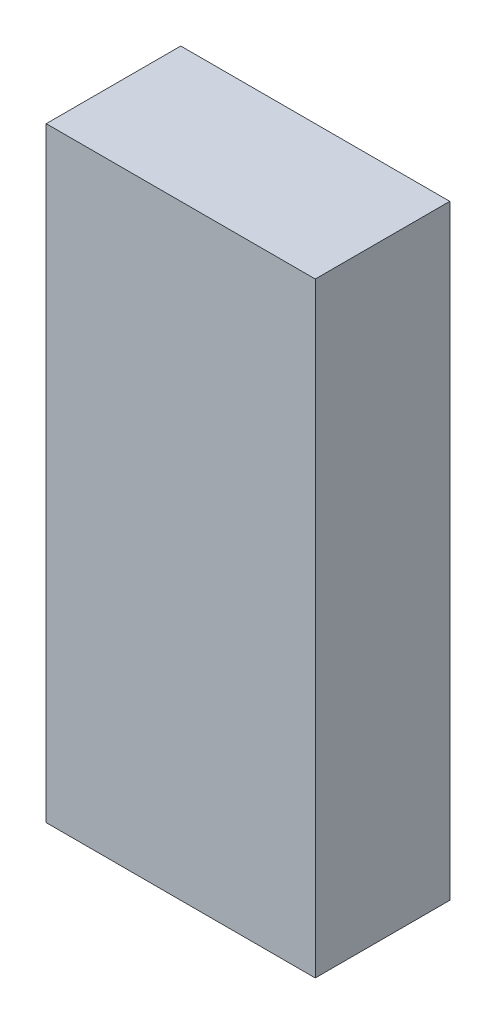
ISO-10303-21;
HEADER;
FILE_DESCRIPTION(('STEP AP214'),'2;1');
FILE_NAME('part.step','',(''),(''),'','','');
FILE_SCHEMA(('AUTOMOTIVE_DESIGN { 1 0 10303 214 1 1 1 1 }'));
ENDSEC;
DATA;
#1=APPLICATION_CONTEXT('core data for automotive mechanical design processes');
#2=APPLICATION_PROTOCOL_DEFINITION('international standard','automotive_design',2000,#1);
#3=PRODUCT_CONTEXT('',#1,'mechanical');
#4=PRODUCT('Part','Part','',(#3));
#5=PRODUCT_RELATED_PRODUCT_CATEGORY('part','',(#4));
#6=PRODUCT_DEFINITION_FORMATION('','',#4);
#7=PRODUCT_DEFINITION_CONTEXT('part definition',#1,'design');
#8=PRODUCT_DEFINITION('design','',#6,#7);
#9=PRODUCT_DEFINITION_SHAPE('','',#8);
#10=(LENGTH_UNIT() NAMED_UNIT(*) SI_UNIT(.MILLI.,.METRE.));
#11=(NAMED_UNIT(*) PLANE_ANGLE_UNIT() SI_UNIT($,.RADIAN.));
#12=(NAMED_UNIT(*) SI_UNIT($,.STERADIAN.) SOLID_ANGLE_UNIT());
#13=UNCERTAINTY_MEASURE_WITH_UNIT(LENGTH_MEASURE(1.E-05),#10,'distance_accuracy_value','');
#14=(GEOMETRIC_REPRESENTATION_CONTEXT(3) GLOBAL_UNCERTAINTY_ASSIGNED_CONTEXT((#13)) GLOBAL_UNIT_ASSIGNED_CONTEXT((#10,
#11,#12)) REPRESENTATION_CONTEXT('',''));
#15=CARTESIAN_POINT('',(0.,0.,0.));
#16=DIRECTION('',(0.,0.,1.));
#17=DIRECTION('',(1.,0.,0.));
#18=AXIS2_PLACEMENT_3D('',#15,#16,#17);
#19=CARTESIAN_POINT('',(-1.1,2.525,0.));
#20=DIRECTION('',(1.,0.,0.));
#21=DIRECTION('',(0.,0.,1.));
#22=AXIS2_PLACEMENT_3D('',#19,#20,#21);
#23=PLANE('',#22);
#24=DIRECTION('',(0.,1.,0.));
#25=VECTOR('',#24,1.);
#26=CARTESIAN_POINT('',(-1.1,2.525,0.1));
#27=LINE('',#26,#25);
#28=CARTESIAN_POINT('',(-1.1,2.525,0.1));
#29=VERTEX_POINT('',#28);
#30=CARTESIAN_POINT('',(-1.1,2.975,0.1));
#31=VERTEX_POINT('',#30);
#32=EDGE_CURVE('E11',#29,#31,#27,.T.);
#33=ORIENTED_EDGE('',*,*,#32,.T.);
#34=DIRECTION('',(0.,0.,1.));
#35=VECTOR('',#34,1.);
#36=CARTESIAN_POINT('',(-1.1,2.975,0.));
#37=LINE('',#36,#35);
#38=CARTESIAN_POINT('',(-1.1,2.975,0.));
#39=VERTEX_POINT('',#38);
#40=EDGE_CURVE('E24',#39,#31,#37,.T.);
#41=ORIENTED_EDGE('',*,*,#40,.F.);
#42=DIRECTION('',(0.,1.,0.));
#43=VECTOR('',#42,1.);
#44=CARTESIAN_POINT('',(-1.1,2.525,0.));
#45=LINE('',#44,#43);
#46=CARTESIAN_POINT('',(-1.1,2.525,0.));
#47=VERTEX_POINT('',#46);
#48=EDGE_CURVE('E86',#47,#39,#45,.T.);
#49=ORIENTED_EDGE('',*,*,#48,.F.);
#50=DIRECTION('',(0.,0.,1.));
#51=VECTOR('',#50,1.);
#52=CARTESIAN_POINT('',(-1.1,2.525,0.));
#53=LINE('',#52,#51);
#54=EDGE_CURVE('E36',#47,#29,#53,.T.);
#55=ORIENTED_EDGE('',*,*,#54,.T.);
#56=EDGE_LOOP('',(#33,#41,#49,#55));
#57=FACE_BOUND('',#56,.T.);
#58=ADVANCED_FACE('F17',(#57),#23,.F.);
#59=CARTESIAN_POINT('',(-0.9,2.525,0.));
#60=DIRECTION('',(1.,0.,0.));
#61=DIRECTION('',(0.,0.,1.));
#62=AXIS2_PLACEMENT_3D('',#59,#60,#61);
#63=PLANE('',#62);
#64=DIRECTION('',(0.,0.,1.));
#65=VECTOR('',#64,1.);
#66=CARTESIAN_POINT('',(-0.9,2.525,0.));
#67=LINE('',#66,#65);
#68=CARTESIAN_POINT('',(-0.9,2.525,0.));
#69=VERTEX_POINT('',#68);
#70=CARTESIAN_POINT('',(-0.9,2.525,0.1));
#71=VERTEX_POINT('',#70);
#72=EDGE_CURVE('E83',#69,#71,#67,.T.);
#73=ORIENTED_EDGE('',*,*,#72,.F.);
#74=DIRECTION('',(0.,1.,0.));
#75=VECTOR('',#74,1.);
#76=CARTESIAN_POINT('',(-0.9,2.525,0.));
#77=LINE('',#76,#75);
#78=CARTESIAN_POINT('',(-0.9,2.975,0.));
#79=VERTEX_POINT('',#78);
#80=EDGE_CURVE('E63',#69,#79,#77,.T.);
#81=ORIENTED_EDGE('',*,*,#80,.T.);
#82=DIRECTION('',(0.,0.,1.));
#83=VECTOR('',#82,1.);
#84=CARTESIAN_POINT('',(-0.9,2.975,0.));
#85=LINE('',#84,#83);
#86=CARTESIAN_POINT('',(-0.9,2.975,0.1));
#87=VERTEX_POINT('',#86);
#88=EDGE_CURVE('E57',#79,#87,#85,.T.);
#89=ORIENTED_EDGE('',*,*,#88,.T.);
#90=DIRECTION('',(0.,1.,0.));
#91=VECTOR('',#90,1.);
#92=CARTESIAN_POINT('',(-0.9,2.525,0.1));
#93=LINE('',#92,#91);
#94=EDGE_CURVE('E60',#71,#87,#93,.T.);
#95=ORIENTED_EDGE('',*,*,#94,.F.);
#96=EDGE_LOOP('',(#73,#81,#89,#95));
#97=FACE_BOUND('',#96,.T.);
#98=ADVANCED_FACE('F59',(#97),#63,.T.);
#99=CARTESIAN_POINT('',(-1.1,2.525,0.));
#100=DIRECTION('',(0.,1.,0.));
#101=DIRECTION('',(0.,0.,1.));
#102=AXIS2_PLACEMENT_3D('',#99,#100,#101);
#103=PLANE('',#102);
#104=ORIENTED_EDGE('',*,*,#72,.T.);
#105=DIRECTION('',(1.,0.,0.));
#106=VECTOR('',#105,1.);
#107=CARTESIAN_POINT('',(-1.1,2.525,0.1));
#108=LINE('',#107,#106);
#109=EDGE_CURVE('E71',#29,#71,#108,.T.);
#110=ORIENTED_EDGE('',*,*,#109,.F.);
#111=ORIENTED_EDGE('',*,*,#54,.F.);
#112=DIRECTION('',(1.,0.,0.));
#113=VECTOR('',#112,1.);
#114=CARTESIAN_POINT('',(-1.1,2.525,0.));
#115=LINE('',#114,#113);
#116=EDGE_CURVE('E76',#47,#69,#115,.T.);
#117=ORIENTED_EDGE('',*,*,#116,.T.);
#118=EDGE_LOOP('',(#104,#110,#111,#117));
#119=FACE_BOUND('',#118,.T.);
#120=ADVANCED_FACE('F91',(#119),#103,.F.);
#121=CARTESIAN_POINT('',(-1.1,2.975,0.));
#122=DIRECTION('',(0.,1.,0.));
#123=DIRECTION('',(0.,0.,1.));
#124=AXIS2_PLACEMENT_3D('',#121,#122,#123);
#125=PLANE('',#124);
#126=DIRECTION('',(1.,0.,0.));
#127=VECTOR('',#126,1.);
#128=CARTESIAN_POINT('',(-1.1,2.975,0.));
#129=LINE('',#128,#127);
#130=EDGE_CURVE('E74',#39,#79,#129,.T.);
#131=ORIENTED_EDGE('',*,*,#130,.F.);
#132=ORIENTED_EDGE('',*,*,#40,.T.);
#133=DIRECTION('',(1.,0.,0.));
#134=VECTOR('',#133,1.);
#135=CARTESIAN_POINT('',(-1.1,2.975,0.1));
#136=LINE('',#135,#134);
#137=EDGE_CURVE('E69',#31,#87,#136,.T.);
#138=ORIENTED_EDGE('',*,*,#137,.T.);
#139=ORIENTED_EDGE('',*,*,#88,.F.);
#140=EDGE_LOOP('',(#131,#132,#138,#139));
#141=FACE_BOUND('',#140,.T.);
#142=ADVANCED_FACE('F73',(#141),#125,.T.);
#143=CARTESIAN_POINT('',(-1.1,2.525,0.));
#144=DIRECTION('',(0.,0.,1.));
#145=DIRECTION('',(1.,0.,0.));
#146=AXIS2_PLACEMENT_3D('',#143,#144,#145);
#147=PLANE('',#146);
#148=ORIENTED_EDGE('',*,*,#130,.T.);
#149=ORIENTED_EDGE('',*,*,#80,.F.);
#150=ORIENTED_EDGE('',*,*,#116,.F.);
#151=ORIENTED_EDGE('',*,*,#48,.T.);
#152=EDGE_LOOP('',(#148,#149,#150,#151));
#153=FACE_BOUND('',#152,.T.);
#154=ADVANCED_FACE('F89',(#153),#147,.F.);
#155=CARTESIAN_POINT('',(-1.1,2.525,0.1));
#156=DIRECTION('',(0.,0.,1.));
#157=DIRECTION('',(1.,0.,0.));
#158=AXIS2_PLACEMENT_3D('',#155,#156,#157);
#159=PLANE('',#158);
#160=ORIENTED_EDGE('',*,*,#32,.F.);
#161=ORIENTED_EDGE('',*,*,#109,.T.);
#162=ORIENTED_EDGE('',*,*,#94,.T.);
#163=ORIENTED_EDGE('',*,*,#137,.F.);
#164=EDGE_LOOP('',(#160,#161,#162,#163));
#165=FACE_BOUND('',#164,.T.);
#166=ADVANCED_FACE('F68',(#165),#159,.T.);
#167=CLOSED_SHELL('',(#58,#98,#120,#142,#154,#166));
#168=MANIFOLD_SOLID_BREP('B1',#167);
#169=ADVANCED_BREP_SHAPE_REPRESENTATION('',(#18,#168),#14);
#170=SHAPE_DEFINITION_REPRESENTATION(#9,#169);
ENDSEC;
END-ISO-10303-21;
